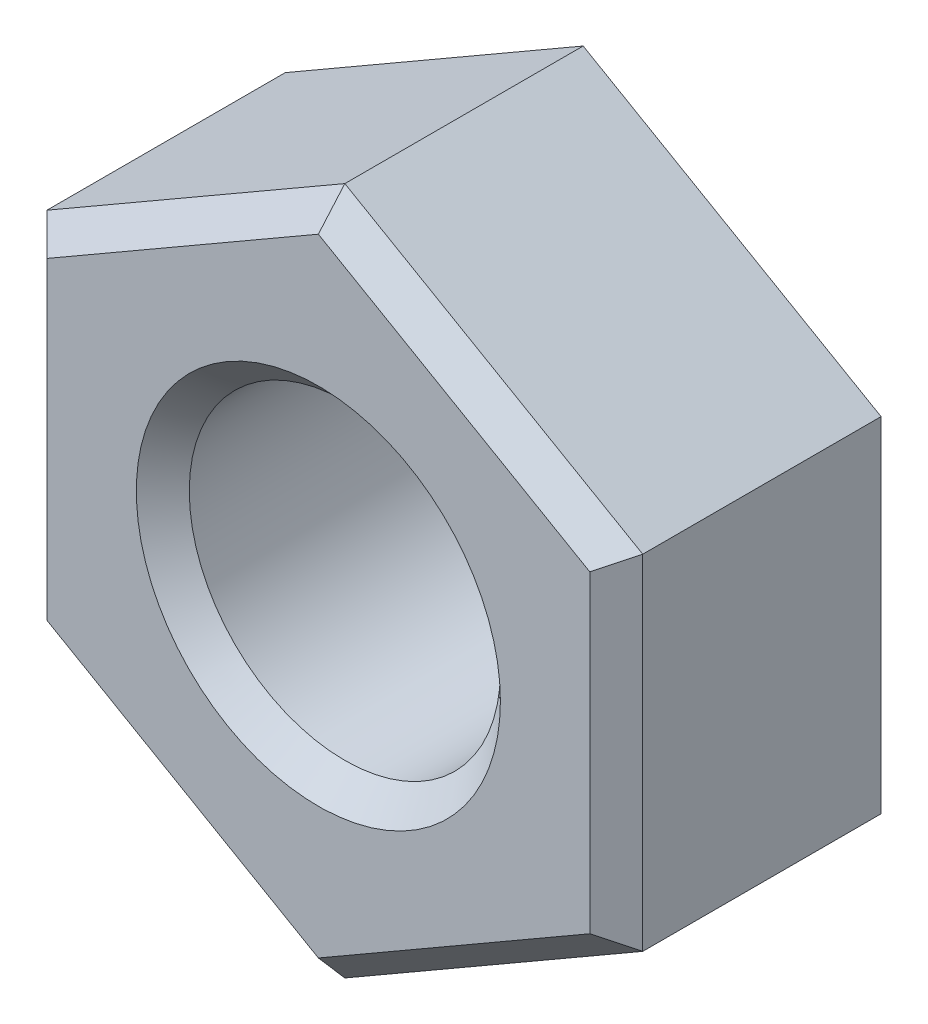
ISO-10303-21;
HEADER;
FILE_DESCRIPTION(('STEP AP214'),'2;1');
FILE_NAME('part.step','',(''),(''),'','','');
FILE_SCHEMA(('AUTOMOTIVE_DESIGN { 1 0 10303 214 1 1 1 1 }'));
ENDSEC;
DATA;
#1=APPLICATION_CONTEXT('core data for automotive mechanical design processes');
#2=APPLICATION_PROTOCOL_DEFINITION('international standard','automotive_design',2000,#1);
#3=PRODUCT_CONTEXT('',#1,'mechanical');
#4=PRODUCT('Part','Part','',(#3));
#5=PRODUCT_RELATED_PRODUCT_CATEGORY('part','',(#4));
#6=PRODUCT_DEFINITION_FORMATION('','',#4);
#7=PRODUCT_DEFINITION_CONTEXT('part definition',#1,'design');
#8=PRODUCT_DEFINITION('design','',#6,#7);
#9=PRODUCT_DEFINITION_SHAPE('','',#8);
#10=(LENGTH_UNIT() NAMED_UNIT(*) SI_UNIT(.MILLI.,.METRE.));
#11=(NAMED_UNIT(*) PLANE_ANGLE_UNIT() SI_UNIT($,.RADIAN.));
#12=(NAMED_UNIT(*) SI_UNIT($,.STERADIAN.) SOLID_ANGLE_UNIT());
#13=UNCERTAINTY_MEASURE_WITH_UNIT(LENGTH_MEASURE(1.E-05),#10,'distance_accuracy_value','');
#14=(GEOMETRIC_REPRESENTATION_CONTEXT(3) GLOBAL_UNCERTAINTY_ASSIGNED_CONTEXT((#13)) GLOBAL_UNIT_ASSIGNED_CONTEXT((#10,
#11,#12)) REPRESENTATION_CONTEXT('',''));
#15=CARTESIAN_POINT('',(0.,0.,0.));
#16=DIRECTION('',(0.,0.,1.));
#17=DIRECTION('',(1.,0.,0.));
#18=AXIS2_PLACEMENT_3D('',#15,#16,#17);
#19=CARTESIAN_POINT('',(0.,0.,4.));
#20=DIRECTION('',(0.,0.,1.));
#21=DIRECTION('',(1.,0.,0.));
#22=AXIS2_PLACEMENT_3D('',#19,#20,#21);
#23=PLANE('',#22);
#24=CARTESIAN_POINT('',(0.,0.,4.));
#25=DIRECTION('',(0.,0.,1.));
#26=DIRECTION('',(1.,0.,0.));
#27=AXIS2_PLACEMENT_3D('',#24,#25,#26);
#28=CIRCLE('',#27,2.75);
#29=CARTESIAN_POINT('',(2.75,0.,4.));
#30=VERTEX_POINT('',#29);
#31=EDGE_CURVE('E168',#30,#30,#28,.F.);
#32=ORIENTED_EDGE('',*,*,#31,.T.);
#33=EDGE_LOOP('',(#32));
#34=FACE_BOUND('',#33,.T.);
#35=DIRECTION('',(0.,-1.,0.));
#36=VECTOR('',#35,1.);
#37=CARTESIAN_POINT('',(-4.1,-2.59807621135331,4.));
#38=LINE('',#37,#36);
#39=CARTESIAN_POINT('',(-4.1,2.36713610367746,4.));
#40=VERTEX_POINT('',#39);
#41=CARTESIAN_POINT('',(-4.1,-2.36713610367746,4.));
#42=VERTEX_POINT('',#41);
#43=EDGE_CURVE('E163',#40,#42,#38,.T.);
#44=ORIENTED_EDGE('',*,*,#43,.T.);
#45=DIRECTION('',(0.866025403784438,-0.5,0.));
#46=VECTOR('',#45,1.);
#47=CARTESIAN_POINT('',(0.199999999999998,-4.84974226119285,4.));
#48=LINE('',#47,#46);
#49=CARTESIAN_POINT('',(0.,-4.73427220735493,4.));
#50=VERTEX_POINT('',#49);
#51=EDGE_CURVE('E165',#42,#50,#48,.T.);
#52=ORIENTED_EDGE('',*,*,#51,.T.);
#53=DIRECTION('',(0.866025403784439,0.5,0.));
#54=VECTOR('',#53,1.);
#55=CARTESIAN_POINT('',(4.3,-2.25166604983954,4.));
#56=LINE('',#55,#54);
#57=CARTESIAN_POINT('',(4.1,-2.36713610367746,4.));
#58=VERTEX_POINT('',#57);
#59=EDGE_CURVE('E155',#50,#58,#56,.T.);
#60=ORIENTED_EDGE('',*,*,#59,.T.);
#61=DIRECTION('',(0.,1.,0.));
#62=VECTOR('',#61,1.);
#63=CARTESIAN_POINT('',(4.1,2.59807621135332,4.));
#64=LINE('',#63,#62);
#65=CARTESIAN_POINT('',(4.1,2.36713610367747,4.));
#66=VERTEX_POINT('',#65);
#67=EDGE_CURVE('E157',#58,#66,#64,.T.);
#68=ORIENTED_EDGE('',*,*,#67,.T.);
#69=DIRECTION('',(-0.866025403784439,0.5,0.));
#70=VECTOR('',#69,1.);
#71=CARTESIAN_POINT('',(-0.2,4.84974226119286,4.));
#72=LINE('',#71,#70);
#73=CARTESIAN_POINT('',(0.,4.73427220735493,4.));
#74=VERTEX_POINT('',#73);
#75=EDGE_CURVE('E159',#66,#74,#72,.T.);
#76=ORIENTED_EDGE('',*,*,#75,.T.);
#77=DIRECTION('',(-0.866025403784439,-0.5,0.));
#78=VECTOR('',#77,1.);
#79=CARTESIAN_POINT('',(-4.3,2.25166604983954,4.));
#80=LINE('',#79,#78);
#81=EDGE_CURVE('E161',#74,#40,#80,.T.);
#82=ORIENTED_EDGE('',*,*,#81,.T.);
#83=EDGE_LOOP('',(#44,#52,#60,#68,#76,#82));
#84=FACE_BOUND('',#83,.T.);
#85=ADVANCED_FACE('F35',(#34,#84),#23,.T.);
#86=CARTESIAN_POINT('',(0.,0.,0.));
#87=DIRECTION('',(0.,0.,1.));
#88=DIRECTION('',(1.,0.,0.));
#89=AXIS2_PLACEMENT_3D('',#86,#87,#88);
#90=PLANE('',#89);
#91=DIRECTION('',(0.866025403784438,0.5,0.));
#92=VECTOR('',#91,1.);
#93=CARTESIAN_POINT('',(0.,-5.19615242270663,0.));
#94=LINE('',#93,#92);
#95=CARTESIAN_POINT('',(0.,-5.19615242270663,0.));
#96=VERTEX_POINT('',#95);
#97=CARTESIAN_POINT('',(4.5,-2.59807621135331,0.));
#98=VERTEX_POINT('',#97);
#99=EDGE_CURVE('E122',#96,#98,#94,.T.);
#100=ORIENTED_EDGE('',*,*,#99,.F.);
#101=DIRECTION('',(0.866025403784438,-0.5,0.));
#102=VECTOR('',#101,1.);
#103=CARTESIAN_POINT('',(-4.5,-2.59807621135331,0.));
#104=LINE('',#103,#102);
#105=CARTESIAN_POINT('',(-4.5,-2.59807621135331,0.));
#106=VERTEX_POINT('',#105);
#107=EDGE_CURVE('E143',#106,#96,#104,.T.);
#108=ORIENTED_EDGE('',*,*,#107,.F.);
#109=DIRECTION('',(0.,-1.,0.));
#110=VECTOR('',#109,1.);
#111=CARTESIAN_POINT('',(-4.5,2.59807621135332,0.));
#112=LINE('',#111,#110);
#113=CARTESIAN_POINT('',(-4.5,2.59807621135332,0.));
#114=VERTEX_POINT('',#113);
#115=EDGE_CURVE('E140',#114,#106,#112,.T.);
#116=ORIENTED_EDGE('',*,*,#115,.F.);
#117=DIRECTION('',(-0.866025403784439,-0.5,0.));
#118=VECTOR('',#117,1.);
#119=CARTESIAN_POINT('',(0.,5.19615242270663,0.));
#120=LINE('',#119,#118);
#121=CARTESIAN_POINT('',(0.,5.19615242270663,0.));
#122=VERTEX_POINT('',#121);
#123=EDGE_CURVE('E137',#122,#114,#120,.T.);
#124=ORIENTED_EDGE('',*,*,#123,.F.);
#125=DIRECTION('',(-0.866025403784438,0.5,0.));
#126=VECTOR('',#125,1.);
#127=CARTESIAN_POINT('',(4.5,2.59807621135332,0.));
#128=LINE('',#127,#126);
#129=CARTESIAN_POINT('',(4.5,2.59807621135332,0.));
#130=VERTEX_POINT('',#129);
#131=EDGE_CURVE('E125',#130,#122,#128,.T.);
#132=ORIENTED_EDGE('',*,*,#131,.F.);
#133=DIRECTION('',(0.,1.,0.));
#134=VECTOR('',#133,1.);
#135=CARTESIAN_POINT('',(4.5,-2.59807621135331,0.));
#136=LINE('',#135,#134);
#137=EDGE_CURVE('E109',#98,#130,#136,.T.);
#138=ORIENTED_EDGE('',*,*,#137,.F.);
#139=EDGE_LOOP('',(#100,#108,#116,#124,#132,#138));
#140=FACE_BOUND('',#139,.T.);
#141=CARTESIAN_POINT('',(0.,0.,0.));
#142=DIRECTION('',(0.,0.,1.));
#143=DIRECTION('',(1.,0.,0.));
#144=AXIS2_PLACEMENT_3D('',#141,#142,#143);
#145=CIRCLE('',#144,2.35);
#146=CARTESIAN_POINT('',(2.35,0.,0.));
#147=VERTEX_POINT('',#146);
#148=EDGE_CURVE('E131',#147,#147,#145,.T.);
#149=ORIENTED_EDGE('',*,*,#148,.T.);
#150=EDGE_LOOP('',(#149));
#151=FACE_BOUND('',#150,.T.);
#152=ADVANCED_FACE('F119',(#140,#151),#90,.F.);
#153=CARTESIAN_POINT('',(0.,-5.19615242270663,4.));
#154=DIRECTION('',(-0.5,0.866025403784439,0.));
#155=DIRECTION('',(-0.866025403784438,-0.5,0.));
#156=AXIS2_PLACEMENT_3D('',#153,#154,#155);
#157=PLANE('',#156);
#158=DIRECTION('',(0.,0.,-1.));
#159=VECTOR('',#158,1.);
#160=CARTESIAN_POINT('',(4.5,-2.59807621135331,4.));
#161=LINE('',#160,#159);
#162=CARTESIAN_POINT('',(4.5,-2.59807621135331,3.6));
#163=VERTEX_POINT('',#162);
#164=EDGE_CURVE('E106',#163,#98,#161,.T.);
#165=ORIENTED_EDGE('',*,*,#164,.F.);
#166=DIRECTION('',(-0.866025403784438,-0.5,0.));
#167=VECTOR('',#166,1.);
#168=CARTESIAN_POINT('',(0.,-5.19615242270663,3.6));
#169=LINE('',#168,#167);
#170=CARTESIAN_POINT('',(0.,-5.19615242270663,3.6));
#171=VERTEX_POINT('',#170);
#172=EDGE_CURVE('E11',#163,#171,#169,.T.);
#173=ORIENTED_EDGE('',*,*,#172,.T.);
#174=DIRECTION('',(0.,0.,-1.));
#175=VECTOR('',#174,1.);
#176=CARTESIAN_POINT('',(0.,-5.19615242270663,4.));
#177=LINE('',#176,#175);
#178=EDGE_CURVE('E129',#171,#96,#177,.T.);
#179=ORIENTED_EDGE('',*,*,#178,.T.);
#180=ORIENTED_EDGE('',*,*,#99,.T.);
#181=EDGE_LOOP('',(#165,#173,#179,#180));
#182=FACE_BOUND('',#181,.T.);
#183=ADVANCED_FACE('F127',(#182),#157,.F.);
#184=CARTESIAN_POINT('',(4.5,-2.59807621135331,4.));
#185=DIRECTION('',(-1.,0.,0.));
#186=DIRECTION('',(0.,0.,1.));
#187=AXIS2_PLACEMENT_3D('',#184,#185,#186);
#188=PLANE('',#187);
#189=DIRECTION('',(0.,0.,-1.));
#190=VECTOR('',#189,1.);
#191=CARTESIAN_POINT('',(4.5,2.59807621135332,4.));
#192=LINE('',#191,#190);
#193=CARTESIAN_POINT('',(4.5,2.59807621135332,3.6));
#194=VERTEX_POINT('',#193);
#195=EDGE_CURVE('E115',#194,#130,#192,.T.);
#196=ORIENTED_EDGE('',*,*,#195,.F.);
#197=DIRECTION('',(0.,-1.,0.));
#198=VECTOR('',#197,1.);
#199=CARTESIAN_POINT('',(4.5,-2.59807621135331,3.6));
#200=LINE('',#199,#198);
#201=EDGE_CURVE('E45',#194,#163,#200,.T.);
#202=ORIENTED_EDGE('',*,*,#201,.T.);
#203=ORIENTED_EDGE('',*,*,#164,.T.);
#204=ORIENTED_EDGE('',*,*,#137,.T.);
#205=EDGE_LOOP('',(#196,#202,#203,#204));
#206=FACE_BOUND('',#205,.T.);
#207=ADVANCED_FACE('F108',(#206),#188,.F.);
#208=CARTESIAN_POINT('',(4.5,2.59807621135332,4.));
#209=DIRECTION('',(-0.5,-0.866025403784439,0.));
#210=DIRECTION('',(0.866025403784438,-0.5,0.));
#211=AXIS2_PLACEMENT_3D('',#208,#209,#210);
#212=PLANE('',#211);
#213=DIRECTION('',(0.,0.,-1.));
#214=VECTOR('',#213,1.);
#215=CARTESIAN_POINT('',(0.,5.19615242270663,4.));
#216=LINE('',#215,#214);
#217=CARTESIAN_POINT('',(0.,5.19615242270663,3.6));
#218=VERTEX_POINT('',#217);
#219=EDGE_CURVE('E150',#218,#122,#216,.T.);
#220=ORIENTED_EDGE('',*,*,#219,.F.);
#221=DIRECTION('',(0.866025403784438,-0.5,0.));
#222=VECTOR('',#221,1.);
#223=CARTESIAN_POINT('',(4.5,2.59807621135332,3.6));
#224=LINE('',#223,#222);
#225=EDGE_CURVE('E60',#218,#194,#224,.T.);
#226=ORIENTED_EDGE('',*,*,#225,.T.);
#227=ORIENTED_EDGE('',*,*,#195,.T.);
#228=ORIENTED_EDGE('',*,*,#131,.T.);
#229=EDGE_LOOP('',(#220,#226,#227,#228));
#230=FACE_BOUND('',#229,.T.);
#231=ADVANCED_FACE('F227',(#230),#212,.F.);
#232=CARTESIAN_POINT('',(0.,5.19615242270663,4.));
#233=DIRECTION('',(0.5,-0.866025403784439,0.));
#234=DIRECTION('',(0.866025403784439,0.5,0.));
#235=AXIS2_PLACEMENT_3D('',#232,#233,#234);
#236=PLANE('',#235);
#237=DIRECTION('',(0.,0.,-1.));
#238=VECTOR('',#237,1.);
#239=CARTESIAN_POINT('',(-4.5,2.59807621135332,4.));
#240=LINE('',#239,#238);
#241=CARTESIAN_POINT('',(-4.5,2.59807621135332,3.6));
#242=VERTEX_POINT('',#241);
#243=EDGE_CURVE('E148',#242,#114,#240,.T.);
#244=ORIENTED_EDGE('',*,*,#243,.F.);
#245=DIRECTION('',(0.866025403784439,0.5,0.));
#246=VECTOR('',#245,1.);
#247=CARTESIAN_POINT('',(0.,5.19615242270663,3.6));
#248=LINE('',#247,#246);
#249=EDGE_CURVE('E176',#242,#218,#248,.T.);
#250=ORIENTED_EDGE('',*,*,#249,.T.);
#251=ORIENTED_EDGE('',*,*,#219,.T.);
#252=ORIENTED_EDGE('',*,*,#123,.T.);
#253=EDGE_LOOP('',(#244,#250,#251,#252));
#254=FACE_BOUND('',#253,.T.);
#255=ADVANCED_FACE('F225',(#254),#236,.F.);
#256=CARTESIAN_POINT('',(-4.5,2.59807621135332,4.));
#257=DIRECTION('',(1.,0.,0.));
#258=DIRECTION('',(0.,1.,0.));
#259=AXIS2_PLACEMENT_3D('',#256,#257,#258);
#260=PLANE('',#259);
#261=DIRECTION('',(0.,0.,-1.));
#262=VECTOR('',#261,1.);
#263=CARTESIAN_POINT('',(-4.5,-2.59807621135331,4.));
#264=LINE('',#263,#262);
#265=CARTESIAN_POINT('',(-4.5,-2.59807621135331,3.6));
#266=VERTEX_POINT('',#265);
#267=EDGE_CURVE('E146',#266,#106,#264,.T.);
#268=ORIENTED_EDGE('',*,*,#267,.F.);
#269=DIRECTION('',(0.,1.,0.));
#270=VECTOR('',#269,1.);
#271=CARTESIAN_POINT('',(-4.5,2.59807621135332,3.6));
#272=LINE('',#271,#270);
#273=EDGE_CURVE('E174',#266,#242,#272,.T.);
#274=ORIENTED_EDGE('',*,*,#273,.T.);
#275=ORIENTED_EDGE('',*,*,#243,.T.);
#276=ORIENTED_EDGE('',*,*,#115,.T.);
#277=EDGE_LOOP('',(#268,#274,#275,#276));
#278=FACE_BOUND('',#277,.T.);
#279=ADVANCED_FACE('F223',(#278),#260,.F.);
#280=CARTESIAN_POINT('',(-4.5,-2.59807621135331,4.));
#281=DIRECTION('',(0.5,0.866025403784439,0.));
#282=DIRECTION('',(-0.866025403784438,0.5,0.));
#283=AXIS2_PLACEMENT_3D('',#280,#281,#282);
#284=PLANE('',#283);
#285=ORIENTED_EDGE('',*,*,#178,.F.);
#286=DIRECTION('',(-0.866025403784438,0.5,0.));
#287=VECTOR('',#286,1.);
#288=CARTESIAN_POINT('',(-4.5,-2.59807621135331,3.6));
#289=LINE('',#288,#287);
#290=EDGE_CURVE('E171',#171,#266,#289,.T.);
#291=ORIENTED_EDGE('',*,*,#290,.T.);
#292=ORIENTED_EDGE('',*,*,#267,.T.);
#293=ORIENTED_EDGE('',*,*,#107,.T.);
#294=EDGE_LOOP('',(#285,#291,#292,#293));
#295=FACE_BOUND('',#294,.T.);
#296=ADVANCED_FACE('F211',(#295),#284,.F.);
#297=CARTESIAN_POINT('',(0.,0.,4.));
#298=DIRECTION('',(0.,0.,-1.));
#299=DIRECTION('',(-1.,0.,0.));
#300=AXIS2_PLACEMENT_3D('',#297,#298,#299);
#301=CYLINDRICAL_SURFACE('',#300,2.35);
#302=CARTESIAN_POINT('',(0.,0.,3.6));
#303=DIRECTION('',(0.,0.,1.));
#304=DIRECTION('',(1.,0.,0.));
#305=AXIS2_PLACEMENT_3D('',#302,#303,#304);
#306=CIRCLE('',#305,2.35);
#307=CARTESIAN_POINT('',(2.35,0.,3.6));
#308=VERTEX_POINT('',#307);
#309=EDGE_CURVE('E114',#308,#308,#306,.T.);
#310=ORIENTED_EDGE('',*,*,#309,.T.);
#311=EDGE_LOOP('',(#310));
#312=FACE_BOUND('',#311,.T.);
#313=ORIENTED_EDGE('',*,*,#148,.F.);
#314=EDGE_LOOP('',(#313));
#315=FACE_BOUND('',#314,.T.);
#316=ADVANCED_FACE('F245',(#312,#315),#301,.F.);
#317=CARTESIAN_POINT('',(0.,0.,3.6));
#318=DIRECTION('',(0.,0.,1.));
#319=DIRECTION('',(1.,0.,0.));
#320=AXIS2_PLACEMENT_3D('',#317,#318,#319);
#321=CONICAL_SURFACE('',#320,2.35,0.78539816339745);
#322=ORIENTED_EDGE('',*,*,#31,.F.);
#323=EDGE_LOOP('',(#322));
#324=FACE_BOUND('',#323,.T.);
#325=ORIENTED_EDGE('',*,*,#309,.F.);
#326=EDGE_LOOP('',(#325));
#327=FACE_BOUND('',#326,.T.);
#328=ADVANCED_FACE('F264',(#324,#327),#321,.F.);
#329=CARTESIAN_POINT('',(2.05,3.5507041555162,4.));
#330=DIRECTION('',(0.353553390593274,0.612372435695795,0.707106781186547));
#331=DIRECTION('',(0.866025403784438,-0.5,0.));
#332=AXIS2_PLACEMENT_3D('',#329,#330,#331);
#333=PLANE('',#332);
#334=DIRECTION('',(-0.654653670707976,-0.377964473009228,0.654653670707978));
#335=VECTOR('',#334,1.);
#336=CARTESIAN_POINT('',(3.51428571428571,2.02897380315211,4.58571428571429));
#337=LINE('',#336,#335);
#338=EDGE_CURVE('E189',#194,#66,#337,.T.);
#339=ORIENTED_EDGE('',*,*,#338,.F.);
#340=ORIENTED_EDGE('',*,*,#225,.F.);
#341=DIRECTION('',(0.,-0.755928946018454,0.654653670707978));
#342=VECTOR('',#341,1.);
#343=CARTESIAN_POINT('',(0.,4.05794760630423,4.58571428571428));
#344=LINE('',#343,#342);
#345=EDGE_CURVE('E40',#74,#218,#344,.F.);
#346=ORIENTED_EDGE('',*,*,#345,.F.);
#347=ORIENTED_EDGE('',*,*,#75,.F.);
#348=EDGE_LOOP('',(#339,#340,#346,#347));
#349=FACE_BOUND('',#348,.T.);
#350=ADVANCED_FACE('F38',(#349),#333,.T.);
#351=CARTESIAN_POINT('',(-2.05,3.5507041555162,4.));
#352=DIRECTION('',(-0.353553390593275,0.612372435695796,0.707106781186546));
#353=DIRECTION('',(0.866025403784439,0.5,0.));
#354=AXIS2_PLACEMENT_3D('',#351,#352,#353);
#355=PLANE('',#354);
#356=ORIENTED_EDGE('',*,*,#345,.T.);
#357=ORIENTED_EDGE('',*,*,#249,.F.);
#358=DIRECTION('',(0.654653670707975,-0.377964473009227,0.654653670707979));
#359=VECTOR('',#358,1.);
#360=CARTESIAN_POINT('',(-3.51428571428572,2.02897380315211,4.58571428571429));
#361=LINE('',#360,#359);
#362=EDGE_CURVE('E187',#40,#242,#361,.F.);
#363=ORIENTED_EDGE('',*,*,#362,.F.);
#364=ORIENTED_EDGE('',*,*,#81,.F.);
#365=EDGE_LOOP('',(#356,#357,#363,#364));
#366=FACE_BOUND('',#365,.T.);
#367=ADVANCED_FACE('F199',(#366),#355,.T.);
#368=CARTESIAN_POINT('',(4.1,0.,4.));
#369=DIRECTION('',(0.707106781186549,0.,0.707106781186546));
#370=DIRECTION('',(0.,-1.,0.));
#371=AXIS2_PLACEMENT_3D('',#368,#369,#370);
#372=PLANE('',#371);
#373=ORIENTED_EDGE('',*,*,#338,.T.);
#374=ORIENTED_EDGE('',*,*,#67,.F.);
#375=DIRECTION('',(-0.654653670707976,0.377964473009225,0.654653670707979));
#376=VECTOR('',#375,1.);
#377=CARTESIAN_POINT('',(3.51428571428571,-2.02897380315211,4.58571428571429));
#378=LINE('',#377,#376);
#379=EDGE_CURVE('E184',#163,#58,#378,.T.);
#380=ORIENTED_EDGE('',*,*,#379,.F.);
#381=ORIENTED_EDGE('',*,*,#201,.F.);
#382=EDGE_LOOP('',(#373,#374,#380,#381));
#383=FACE_BOUND('',#382,.T.);
#384=ADVANCED_FACE('F203',(#383),#372,.T.);
#385=CARTESIAN_POINT('',(-4.1,0.,4.));
#386=DIRECTION('',(-0.707106781186549,0.,0.707106781186546));
#387=DIRECTION('',(0.,1.,0.));
#388=AXIS2_PLACEMENT_3D('',#385,#386,#387);
#389=PLANE('',#388);
#390=ORIENTED_EDGE('',*,*,#362,.T.);
#391=ORIENTED_EDGE('',*,*,#273,.F.);
#392=DIRECTION('',(0.654653670707976,0.377964473009226,0.654653670707979));
#393=VECTOR('',#392,1.);
#394=CARTESIAN_POINT('',(-3.51428571428572,-2.02897380315211,4.58571428571429));
#395=LINE('',#394,#393);
#396=EDGE_CURVE('E182',#42,#266,#395,.F.);
#397=ORIENTED_EDGE('',*,*,#396,.F.);
#398=ORIENTED_EDGE('',*,*,#43,.F.);
#399=EDGE_LOOP('',(#390,#391,#397,#398));
#400=FACE_BOUND('',#399,.T.);
#401=ADVANCED_FACE('F220',(#400),#389,.T.);
#402=CARTESIAN_POINT('',(2.05,-3.5507041555162,4.));
#403=DIRECTION('',(0.353553390593275,-0.612372435695796,0.707106781186545));
#404=DIRECTION('',(-0.866025403784438,-0.5,0.));
#405=AXIS2_PLACEMENT_3D('',#402,#403,#404);
#406=PLANE('',#405);
#407=ORIENTED_EDGE('',*,*,#379,.T.);
#408=ORIENTED_EDGE('',*,*,#59,.F.);
#409=DIRECTION('',(0.,-0.755928946018453,-0.654653670707979));
#410=VECTOR('',#409,1.);
#411=CARTESIAN_POINT('',(0.,-4.05794760630423,4.58571428571429));
#412=LINE('',#411,#410);
#413=EDGE_CURVE('E180',#171,#50,#412,.F.);
#414=ORIENTED_EDGE('',*,*,#413,.F.);
#415=ORIENTED_EDGE('',*,*,#172,.F.);
#416=EDGE_LOOP('',(#407,#408,#414,#415));
#417=FACE_BOUND('',#416,.T.);
#418=ADVANCED_FACE('F208',(#417),#406,.T.);
#419=CARTESIAN_POINT('',(-2.05,-3.5507041555162,4.));
#420=DIRECTION('',(-0.353553390593275,-0.612372435695796,0.707106781186546));
#421=DIRECTION('',(-0.866025403784438,0.5,0.));
#422=AXIS2_PLACEMENT_3D('',#419,#420,#421);
#423=PLANE('',#422);
#424=ORIENTED_EDGE('',*,*,#396,.T.);
#425=ORIENTED_EDGE('',*,*,#290,.F.);
#426=ORIENTED_EDGE('',*,*,#413,.T.);
#427=ORIENTED_EDGE('',*,*,#51,.F.);
#428=EDGE_LOOP('',(#424,#425,#426,#427));
#429=FACE_BOUND('',#428,.T.);
#430=ADVANCED_FACE('F214',(#429),#423,.T.);
#431=CLOSED_SHELL('',(#85,#152,#183,#207,#231,#255,#279,#296,#316,#328,#350,#367,#384,#401,#418,#430));
#432=MANIFOLD_SOLID_BREP('B2',#431);
#433=ADVANCED_BREP_SHAPE_REPRESENTATION('',(#18,#432),#14);
#434=SHAPE_DEFINITION_REPRESENTATION(#9,#433);
ENDSEC;
END-ISO-10303-21;
